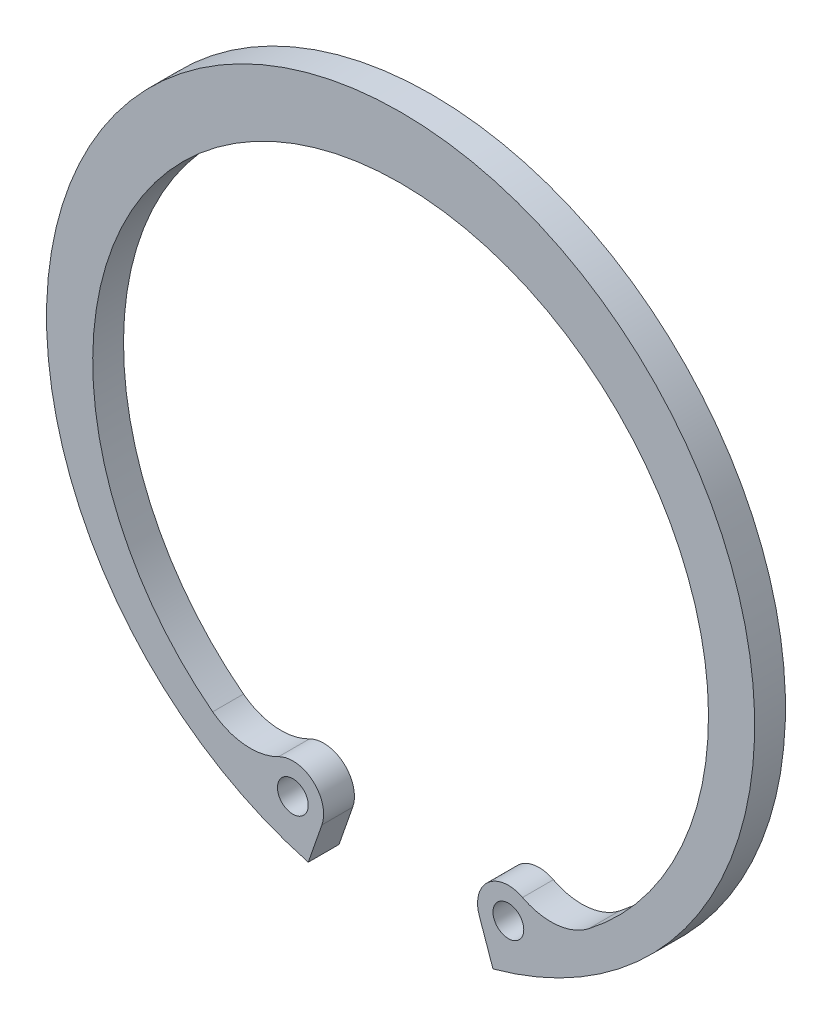
ISO-10303-21;
HEADER;
FILE_DESCRIPTION(('STEP AP214'),'2;1');
FILE_NAME('part.step','',(''),(''),'','','');
FILE_SCHEMA(('AUTOMOTIVE_DESIGN { 1 0 10303 214 1 1 1 1 }'));
ENDSEC;
DATA;
#1=APPLICATION_CONTEXT('core data for automotive mechanical design processes');
#2=APPLICATION_PROTOCOL_DEFINITION('international standard','automotive_design',2000,#1);
#3=PRODUCT_CONTEXT('',#1,'mechanical');
#4=PRODUCT('Part','Part','',(#3));
#5=PRODUCT_RELATED_PRODUCT_CATEGORY('part','',(#4));
#6=PRODUCT_DEFINITION_FORMATION('','',#4);
#7=PRODUCT_DEFINITION_CONTEXT('part definition',#1,'design');
#8=PRODUCT_DEFINITION('design','',#6,#7);
#9=PRODUCT_DEFINITION_SHAPE('','',#8);
#10=(LENGTH_UNIT() NAMED_UNIT(*) SI_UNIT(.MILLI.,.METRE.));
#11=(NAMED_UNIT(*) PLANE_ANGLE_UNIT() SI_UNIT($,.RADIAN.));
#12=(NAMED_UNIT(*) SI_UNIT($,.STERADIAN.) SOLID_ANGLE_UNIT());
#13=UNCERTAINTY_MEASURE_WITH_UNIT(LENGTH_MEASURE(1.E-05),#10,'distance_accuracy_value','');
#14=(GEOMETRIC_REPRESENTATION_CONTEXT(3) GLOBAL_UNCERTAINTY_ASSIGNED_CONTEXT((#13)) GLOBAL_UNIT_ASSIGNED_CONTEXT((#10,
#11,#12)) REPRESENTATION_CONTEXT('',''));
#15=CARTESIAN_POINT('',(0.,0.,0.));
#16=DIRECTION('',(0.,0.,1.));
#17=DIRECTION('',(1.,0.,0.));
#18=AXIS2_PLACEMENT_3D('',#15,#16,#17);
#19=CARTESIAN_POINT('',(-6.99999999999999,-19.,2.));
#20=DIRECTION('',(0.,0.,-1.));
#21=DIRECTION('',(-1.,0.,0.));
#22=AXIS2_PLACEMENT_3D('',#19,#20,#21);
#23=CYLINDRICAL_SURFACE('',#22,2.);
#24=CARTESIAN_POINT('',(-6.99999999999999,-19.,0.));
#25=DIRECTION('',(0.,0.,1.));
#26=DIRECTION('',(1.,0.,0.));
#27=AXIS2_PLACEMENT_3D('',#24,#25,#26);
#28=CIRCLE('',#27,2.);
#29=CARTESIAN_POINT('',(-5.11175173209465,-19.6591801565221,0.));
#30=VERTEX_POINT('',#29);
#31=CARTESIAN_POINT('',(-7.92153540683791,-17.2249584528964,0.));
#32=VERTEX_POINT('',#31);
#33=EDGE_CURVE('E143',#30,#32,#28,.T.);
#34=ORIENTED_EDGE('',*,*,#33,.T.);
#35=DIRECTION('',(0.,0.,-1.));
#36=VECTOR('',#35,1.);
#37=CARTESIAN_POINT('',(-7.92153540683791,-17.2249584528964,2.));
#38=LINE('',#37,#36);
#39=CARTESIAN_POINT('',(-7.92153540683791,-17.2249584528964,2.));
#40=VERTEX_POINT('',#39);
#41=EDGE_CURVE('E11',#40,#32,#38,.T.);
#42=ORIENTED_EDGE('',*,*,#41,.F.);
#43=CARTESIAN_POINT('',(-6.99999999999999,-19.,2.));
#44=DIRECTION('',(0.,0.,1.));
#45=DIRECTION('',(1.,0.,0.));
#46=AXIS2_PLACEMENT_3D('',#43,#44,#45);
#47=CIRCLE('',#46,2.);
#48=CARTESIAN_POINT('',(-5.11175173209465,-19.6591801565221,2.));
#49=VERTEX_POINT('',#48);
#50=EDGE_CURVE('E167',#49,#40,#47,.T.);
#51=ORIENTED_EDGE('',*,*,#50,.F.);
#52=DIRECTION('',(0.,0.,-1.));
#53=VECTOR('',#52,1.);
#54=CARTESIAN_POINT('',(-5.11175173209465,-19.6591801565221,2.));
#55=LINE('',#54,#53);
#56=EDGE_CURVE('E55',#49,#30,#55,.T.);
#57=ORIENTED_EDGE('',*,*,#56,.T.);
#58=EDGE_LOOP('',(#34,#42,#51,#57));
#59=FACE_BOUND('',#58,.T.);
#60=ADVANCED_FACE('F39',(#59),#23,.T.);
#61=CARTESIAN_POINT('',(-9.76460622051376,-13.6748753586891,2.));
#62=DIRECTION('',(0.,0.,-1.));
#63=DIRECTION('',(-1.,0.,0.));
#64=AXIS2_PLACEMENT_3D('',#61,#62,#63);
#65=CYLINDRICAL_SURFACE('',#64,4.);
#66=CARTESIAN_POINT('',(-9.76460622051376,-13.6748753586891,0.));
#67=DIRECTION('',(0.,0.,1.));
#68=DIRECTION('',(1.,0.,0.));
#69=AXIS2_PLACEMENT_3D('',#66,#67,#68);
#70=CIRCLE('',#69,4.);
#71=CARTESIAN_POINT('',(-12.2057577756422,-16.8435941983614,0.));
#72=VERTEX_POINT('',#71);
#73=EDGE_CURVE('E145',#32,#72,#70,.F.);
#74=ORIENTED_EDGE('',*,*,#73,.T.);
#75=DIRECTION('',(0.,0.,-1.));
#76=VECTOR('',#75,1.);
#77=CARTESIAN_POINT('',(-12.2057577756422,-16.8435941983614,2.));
#78=LINE('',#77,#76);
#79=CARTESIAN_POINT('',(-12.2057577756422,-16.8435941983614,2.));
#80=VERTEX_POINT('',#79);
#81=EDGE_CURVE('E47',#80,#72,#78,.T.);
#82=ORIENTED_EDGE('',*,*,#81,.F.);
#83=CARTESIAN_POINT('',(-9.76460622051376,-13.6748753586891,2.));
#84=DIRECTION('',(0.,0.,1.));
#85=DIRECTION('',(1.,0.,0.));
#86=AXIS2_PLACEMENT_3D('',#83,#84,#85);
#87=CIRCLE('',#86,4.);
#88=EDGE_CURVE('E94',#40,#80,#87,.F.);
#89=ORIENTED_EDGE('',*,*,#88,.F.);
#90=ORIENTED_EDGE('',*,*,#41,.T.);
#91=EDGE_LOOP('',(#74,#82,#89,#90));
#92=FACE_BOUND('',#91,.T.);
#93=ADVANCED_FACE('F181',(#92),#65,.F.);
#94=CARTESIAN_POINT('',(0.,-1.,2.));
#95=DIRECTION('',(0.,0.,-1.));
#96=DIRECTION('',(-1.,0.,0.));
#97=AXIS2_PLACEMENT_3D('',#94,#95,#96);
#98=CYLINDRICAL_SURFACE('',#97,20.);
#99=CARTESIAN_POINT('',(0.,-1.,0.));
#100=DIRECTION('',(0.,0.,1.));
#101=DIRECTION('',(1.,0.,0.));
#102=AXIS2_PLACEMENT_3D('',#99,#100,#101);
#103=CIRCLE('',#102,20.);
#104=CARTESIAN_POINT('',(12.2057577756422,-16.8435941983614,0.));
#105=VERTEX_POINT('',#104);
#106=EDGE_CURVE('E148',#105,#72,#103,.T.);
#107=ORIENTED_EDGE('',*,*,#106,.F.);
#108=DIRECTION('',(0.,0.,-1.));
#109=VECTOR('',#108,1.);
#110=CARTESIAN_POINT('',(12.2057577756422,-16.8435941983614,2.));
#111=LINE('',#110,#109);
#112=CARTESIAN_POINT('',(12.2057577756422,-16.8435941983614,2.));
#113=VERTEX_POINT('',#112);
#114=EDGE_CURVE('E174',#113,#105,#111,.T.);
#115=ORIENTED_EDGE('',*,*,#114,.F.);
#116=CARTESIAN_POINT('',(0.,-1.,2.));
#117=DIRECTION('',(0.,0.,1.));
#118=DIRECTION('',(1.,0.,0.));
#119=AXIS2_PLACEMENT_3D('',#116,#117,#118);
#120=CIRCLE('',#119,20.);
#121=EDGE_CURVE('E180',#113,#80,#120,.T.);
#122=ORIENTED_EDGE('',*,*,#121,.T.);
#123=ORIENTED_EDGE('',*,*,#81,.T.);
#124=EDGE_LOOP('',(#107,#115,#122,#123));
#125=FACE_BOUND('',#124,.T.);
#126=ADVANCED_FACE('F178',(#125),#98,.F.);
#127=CARTESIAN_POINT('',(9.76460622051376,-13.6748753586891,2.));
#128=DIRECTION('',(0.,0.,-1.));
#129=DIRECTION('',(-1.,0.,0.));
#130=AXIS2_PLACEMENT_3D('',#127,#128,#129);
#131=CYLINDRICAL_SURFACE('',#130,4.);
#132=CARTESIAN_POINT('',(9.76460622051376,-13.6748753586891,0.));
#133=DIRECTION('',(0.,0.,1.));
#134=DIRECTION('',(1.,0.,0.));
#135=AXIS2_PLACEMENT_3D('',#132,#133,#134);
#136=CIRCLE('',#135,4.);
#137=CARTESIAN_POINT('',(7.92153540683793,-17.2249584528964,0.));
#138=VERTEX_POINT('',#137);
#139=EDGE_CURVE('E151',#105,#138,#136,.F.);
#140=ORIENTED_EDGE('',*,*,#139,.T.);
#141=DIRECTION('',(0.,0.,-1.));
#142=VECTOR('',#141,1.);
#143=CARTESIAN_POINT('',(7.92153540683793,-17.2249584528964,2.));
#144=LINE('',#143,#142);
#145=CARTESIAN_POINT('',(7.92153540683793,-17.2249584528964,2.));
#146=VERTEX_POINT('',#145);
#147=EDGE_CURVE('E171',#146,#138,#144,.T.);
#148=ORIENTED_EDGE('',*,*,#147,.F.);
#149=CARTESIAN_POINT('',(9.76460622051376,-13.6748753586891,2.));
#150=DIRECTION('',(0.,0.,1.));
#151=DIRECTION('',(1.,0.,0.));
#152=AXIS2_PLACEMENT_3D('',#149,#150,#151);
#153=CIRCLE('',#152,4.);
#154=EDGE_CURVE('E194',#113,#146,#153,.F.);
#155=ORIENTED_EDGE('',*,*,#154,.F.);
#156=ORIENTED_EDGE('',*,*,#114,.T.);
#157=EDGE_LOOP('',(#140,#148,#155,#156));
#158=FACE_BOUND('',#157,.T.);
#159=ADVANCED_FACE('F190',(#158),#131,.F.);
#160=CARTESIAN_POINT('',(7.00000000000001,-19.,2.));
#161=DIRECTION('',(0.,0.,-1.));
#162=DIRECTION('',(-1.,0.,0.));
#163=AXIS2_PLACEMENT_3D('',#160,#161,#162);
#164=CYLINDRICAL_SURFACE('',#163,2.);
#165=CARTESIAN_POINT('',(7.00000000000001,-19.,0.));
#166=DIRECTION('',(0.,0.,1.));
#167=DIRECTION('',(1.,0.,0.));
#168=AXIS2_PLACEMENT_3D('',#165,#166,#167);
#169=CIRCLE('',#168,2.);
#170=CARTESIAN_POINT('',(5.11175173209466,-19.6591801565221,0.));
#171=VERTEX_POINT('',#170);
#172=EDGE_CURVE('E153',#138,#171,#169,.T.);
#173=ORIENTED_EDGE('',*,*,#172,.T.);
#174=DIRECTION('',(0.,0.,-1.));
#175=VECTOR('',#174,1.);
#176=CARTESIAN_POINT('',(5.11175173209466,-19.6591801565221,2.));
#177=LINE('',#176,#175);
#178=CARTESIAN_POINT('',(5.11175173209466,-19.6591801565221,2.));
#179=VERTEX_POINT('',#178);
#180=EDGE_CURVE('E129',#179,#171,#177,.T.);
#181=ORIENTED_EDGE('',*,*,#180,.F.);
#182=CARTESIAN_POINT('',(7.00000000000001,-19.,2.));
#183=DIRECTION('',(0.,0.,1.));
#184=DIRECTION('',(1.,0.,0.));
#185=AXIS2_PLACEMENT_3D('',#182,#183,#184);
#186=CIRCLE('',#185,2.);
#187=EDGE_CURVE('E117',#146,#179,#186,.T.);
#188=ORIENTED_EDGE('',*,*,#187,.F.);
#189=ORIENTED_EDGE('',*,*,#147,.T.);
#190=EDGE_LOOP('',(#173,#181,#188,#189));
#191=FACE_BOUND('',#190,.T.);
#192=ADVANCED_FACE('F193',(#191),#164,.T.);
#193=CARTESIAN_POINT('',(-1.56096060247643,-0.544925300213108,2.));
#194=DIRECTION('',(0.944124133952673,0.329590078261036,0.));
#195=DIRECTION('',(-0.329590078261036,0.944124133952673,0.));
#196=AXIS2_PLACEMENT_3D('',#193,#194,#195);
#197=PLANE('',#196);
#198=DIRECTION('',(0.329590078261036,-0.944124133952673,0.));
#199=VECTOR('',#198,1.);
#200=CARTESIAN_POINT('',(-1.56096060247643,-0.544925300213108,0.));
#201=LINE('',#200,#199);
#202=CARTESIAN_POINT('',(6.,-22.2036033111745,0.));
#203=VERTEX_POINT('',#202);
#204=EDGE_CURVE('E126',#171,#203,#201,.T.);
#205=ORIENTED_EDGE('',*,*,#204,.T.);
#206=DIRECTION('',(0.,0.,-1.));
#207=VECTOR('',#206,1.);
#208=CARTESIAN_POINT('',(6.,-22.2036033111745,2.));
#209=LINE('',#208,#207);
#210=CARTESIAN_POINT('',(6.,-22.2036033111745,2.));
#211=VERTEX_POINT('',#210);
#212=EDGE_CURVE('E123',#211,#203,#209,.T.);
#213=ORIENTED_EDGE('',*,*,#212,.F.);
#214=DIRECTION('',(0.329590078261036,-0.944124133952673,0.));
#215=VECTOR('',#214,1.);
#216=CARTESIAN_POINT('',(-1.56096060247643,-0.544925300213108,2.));
#217=LINE('',#216,#215);
#218=EDGE_CURVE('E109',#179,#211,#217,.T.);
#219=ORIENTED_EDGE('',*,*,#218,.F.);
#220=ORIENTED_EDGE('',*,*,#180,.T.);
#221=EDGE_LOOP('',(#205,#213,#219,#220));
#222=FACE_BOUND('',#221,.T.);
#223=ADVANCED_FACE('F124',(#222),#197,.F.);
#224=CARTESIAN_POINT('',(0.,0.,2.));
#225=DIRECTION('',(0.,0.,-1.));
#226=DIRECTION('',(-1.,0.,0.));
#227=AXIS2_PLACEMENT_3D('',#224,#225,#226);
#228=CYLINDRICAL_SURFACE('',#227,23.);
#229=CARTESIAN_POINT('',(0.,0.,0.));
#230=DIRECTION('',(0.,0.,1.));
#231=DIRECTION('',(1.,0.,0.));
#232=AXIS2_PLACEMENT_3D('',#229,#230,#231);
#233=CIRCLE('',#232,23.);
#234=CARTESIAN_POINT('',(-6.,-22.2036033111745,0.));
#235=VERTEX_POINT('',#234);
#236=EDGE_CURVE('E156',#203,#235,#233,.T.);
#237=ORIENTED_EDGE('',*,*,#236,.T.);
#238=DIRECTION('',(0.,0.,-1.));
#239=VECTOR('',#238,1.);
#240=CARTESIAN_POINT('',(-6.,-22.2036033111745,2.));
#241=LINE('',#240,#239);
#242=CARTESIAN_POINT('',(-6.,-22.2036033111745,2.));
#243=VERTEX_POINT('',#242);
#244=EDGE_CURVE('E82',#243,#235,#241,.T.);
#245=ORIENTED_EDGE('',*,*,#244,.F.);
#246=CARTESIAN_POINT('',(0.,0.,2.));
#247=DIRECTION('',(0.,0.,1.));
#248=DIRECTION('',(1.,0.,0.));
#249=AXIS2_PLACEMENT_3D('',#246,#247,#248);
#250=CIRCLE('',#249,23.);
#251=EDGE_CURVE('E115',#211,#243,#250,.T.);
#252=ORIENTED_EDGE('',*,*,#251,.F.);
#253=ORIENTED_EDGE('',*,*,#212,.T.);
#254=EDGE_LOOP('',(#237,#245,#252,#253));
#255=FACE_BOUND('',#254,.T.);
#256=ADVANCED_FACE('F131',(#255),#228,.T.);
#257=CARTESIAN_POINT('',(-6.99999999999999,-19.,2.));
#258=DIRECTION('',(0.,0.,-1.));
#259=DIRECTION('',(-1.,0.,0.));
#260=AXIS2_PLACEMENT_3D('',#257,#258,#259);
#261=CYLINDRICAL_SURFACE('',#260,1.);
#262=CARTESIAN_POINT('',(-6.99999999999999,-19.,2.));
#263=DIRECTION('',(0.,0.,1.));
#264=DIRECTION('',(1.,0.,0.));
#265=AXIS2_PLACEMENT_3D('',#262,#263,#264);
#266=CIRCLE('',#265,1.);
#267=CARTESIAN_POINT('',(-5.99999999999999,-19.,2.));
#268=VERTEX_POINT('',#267);
#269=EDGE_CURVE('E134',#268,#268,#266,.T.);
#270=ORIENTED_EDGE('',*,*,#269,.T.);
#271=EDGE_LOOP('',(#270));
#272=FACE_BOUND('',#271,.T.);
#273=CARTESIAN_POINT('',(-6.99999999999999,-19.,0.));
#274=DIRECTION('',(0.,0.,1.));
#275=DIRECTION('',(1.,0.,0.));
#276=AXIS2_PLACEMENT_3D('',#273,#274,#275);
#277=CIRCLE('',#276,1.);
#278=CARTESIAN_POINT('',(-5.99999999999999,-19.,0.));
#279=VERTEX_POINT('',#278);
#280=EDGE_CURVE('E161',#279,#279,#277,.T.);
#281=ORIENTED_EDGE('',*,*,#280,.F.);
#282=EDGE_LOOP('',(#281));
#283=FACE_BOUND('',#282,.T.);
#284=ADVANCED_FACE('F202',(#272,#283),#261,.F.);
#285=CARTESIAN_POINT('',(1.56096060247654,-0.544925300213155,2.));
#286=DIRECTION('',(0.944124133952671,-0.32959007826104,0.));
#287=DIRECTION('',(0.32959007826104,0.944124133952671,0.));
#288=AXIS2_PLACEMENT_3D('',#285,#286,#287);
#289=PLANE('',#288);
#290=DIRECTION('',(-0.32959007826104,-0.944124133952671,0.));
#291=VECTOR('',#290,1.);
#292=CARTESIAN_POINT('',(1.56096060247654,-0.544925300213155,0.));
#293=LINE('',#292,#291);
#294=EDGE_CURVE('E158',#30,#235,#293,.T.);
#295=ORIENTED_EDGE('',*,*,#294,.F.);
#296=ORIENTED_EDGE('',*,*,#56,.F.);
#297=DIRECTION('',(-0.32959007826104,-0.944124133952671,0.));
#298=VECTOR('',#297,1.);
#299=CARTESIAN_POINT('',(1.56096060247654,-0.544925300213155,2.));
#300=LINE('',#299,#298);
#301=EDGE_CURVE('E132',#49,#243,#300,.T.);
#302=ORIENTED_EDGE('',*,*,#301,.T.);
#303=ORIENTED_EDGE('',*,*,#244,.T.);
#304=EDGE_LOOP('',(#295,#296,#302,#303));
#305=FACE_BOUND('',#304,.T.);
#306=ADVANCED_FACE('F199',(#305),#289,.T.);
#307=CARTESIAN_POINT('',(7.00000000000001,-19.,2.));
#308=DIRECTION('',(0.,0.,-1.));
#309=DIRECTION('',(-1.,0.,0.));
#310=AXIS2_PLACEMENT_3D('',#307,#308,#309);
#311=CYLINDRICAL_SURFACE('',#310,1.);
#312=CARTESIAN_POINT('',(7.00000000000001,-19.,2.));
#313=DIRECTION('',(0.,0.,1.));
#314=DIRECTION('',(1.,0.,0.));
#315=AXIS2_PLACEMENT_3D('',#312,#313,#314);
#316=CIRCLE('',#315,1.);
#317=CARTESIAN_POINT('',(8.00000000000001,-19.,2.));
#318=VERTEX_POINT('',#317);
#319=EDGE_CURVE('E140',#318,#318,#316,.T.);
#320=ORIENTED_EDGE('',*,*,#319,.T.);
#321=EDGE_LOOP('',(#320));
#322=FACE_BOUND('',#321,.T.);
#323=CARTESIAN_POINT('',(7.00000000000001,-19.,0.));
#324=DIRECTION('',(0.,0.,1.));
#325=DIRECTION('',(1.,0.,0.));
#326=AXIS2_PLACEMENT_3D('',#323,#324,#325);
#327=CIRCLE('',#326,1.);
#328=CARTESIAN_POINT('',(8.00000000000001,-19.,0.));
#329=VERTEX_POINT('',#328);
#330=EDGE_CURVE('E164',#329,#329,#327,.T.);
#331=ORIENTED_EDGE('',*,*,#330,.F.);
#332=EDGE_LOOP('',(#331));
#333=FACE_BOUND('',#332,.T.);
#334=ADVANCED_FACE('F201',(#322,#333),#311,.F.);
#335=CARTESIAN_POINT('',(0.,0.,2.));
#336=DIRECTION('',(0.,0.,1.));
#337=DIRECTION('',(1.,0.,0.));
#338=AXIS2_PLACEMENT_3D('',#335,#336,#337);
#339=PLANE('',#338);
#340=ORIENTED_EDGE('',*,*,#50,.T.);
#341=ORIENTED_EDGE('',*,*,#88,.T.);
#342=ORIENTED_EDGE('',*,*,#121,.F.);
#343=ORIENTED_EDGE('',*,*,#154,.T.);
#344=ORIENTED_EDGE('',*,*,#187,.T.);
#345=ORIENTED_EDGE('',*,*,#218,.T.);
#346=ORIENTED_EDGE('',*,*,#251,.T.);
#347=ORIENTED_EDGE('',*,*,#301,.F.);
#348=EDGE_LOOP('',(#340,#341,#342,#343,#344,#345,#346,#347));
#349=FACE_BOUND('',#348,.T.);
#350=ORIENTED_EDGE('',*,*,#269,.F.);
#351=EDGE_LOOP('',(#350));
#352=FACE_BOUND('',#351,.T.);
#353=ORIENTED_EDGE('',*,*,#319,.F.);
#354=EDGE_LOOP('',(#353));
#355=FACE_BOUND('',#354,.T.);
#356=ADVANCED_FACE('F111',(#349,#352,#355),#339,.T.);
#357=CARTESIAN_POINT('',(0.,0.,0.));
#358=DIRECTION('',(0.,0.,1.));
#359=DIRECTION('',(1.,0.,0.));
#360=AXIS2_PLACEMENT_3D('',#357,#358,#359);
#361=PLANE('',#360);
#362=ORIENTED_EDGE('',*,*,#33,.F.);
#363=ORIENTED_EDGE('',*,*,#294,.T.);
#364=ORIENTED_EDGE('',*,*,#236,.F.);
#365=ORIENTED_EDGE('',*,*,#204,.F.);
#366=ORIENTED_EDGE('',*,*,#172,.F.);
#367=ORIENTED_EDGE('',*,*,#139,.F.);
#368=ORIENTED_EDGE('',*,*,#106,.T.);
#369=ORIENTED_EDGE('',*,*,#73,.F.);
#370=EDGE_LOOP('',(#362,#363,#364,#365,#366,#367,#368,#369));
#371=FACE_BOUND('',#370,.T.);
#372=ORIENTED_EDGE('',*,*,#280,.T.);
#373=EDGE_LOOP('',(#372));
#374=FACE_BOUND('',#373,.T.);
#375=ORIENTED_EDGE('',*,*,#330,.T.);
#376=EDGE_LOOP('',(#375));
#377=FACE_BOUND('',#376,.T.);
#378=ADVANCED_FACE('F185',(#371,#374,#377),#361,.F.);
#379=CLOSED_SHELL('',(#60,#93,#126,#159,#192,#223,#256,#284,#306,#334,#356,#378));
#380=MANIFOLD_SOLID_BREP('B2',#379);
#381=ADVANCED_BREP_SHAPE_REPRESENTATION('',(#18,#380),#14);
#382=SHAPE_DEFINITION_REPRESENTATION(#9,#381);
ENDSEC;
END-ISO-10303-21;
